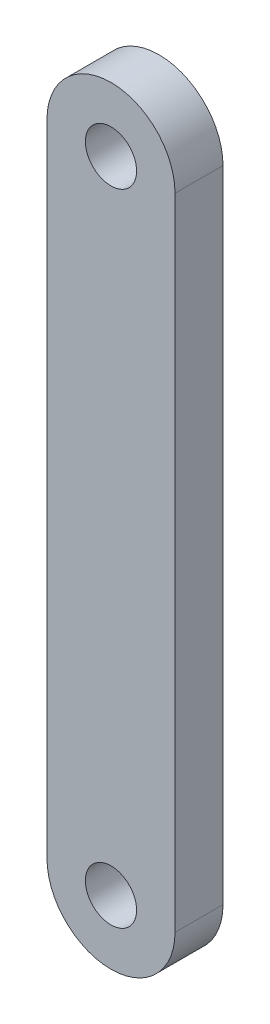
ISO-10303-21;
HEADER;
FILE_DESCRIPTION(('STEP AP214'),'2;1');
FILE_NAME('part.step','',(''),(''),'','','');
FILE_SCHEMA(('AUTOMOTIVE_DESIGN { 1 0 10303 214 1 1 1 1 }'));
ENDSEC;
DATA;
#1=APPLICATION_CONTEXT('core data for automotive mechanical design processes');
#2=APPLICATION_PROTOCOL_DEFINITION('international standard','automotive_design',2000,#1);
#3=PRODUCT_CONTEXT('',#1,'mechanical');
#4=PRODUCT('Part','Part','',(#3));
#5=PRODUCT_RELATED_PRODUCT_CATEGORY('part','',(#4));
#6=PRODUCT_DEFINITION_FORMATION('','',#4);
#7=PRODUCT_DEFINITION_CONTEXT('part definition',#1,'design');
#8=PRODUCT_DEFINITION('design','',#6,#7);
#9=PRODUCT_DEFINITION_SHAPE('','',#8);
#10=(LENGTH_UNIT() NAMED_UNIT(*) SI_UNIT(.MILLI.,.METRE.));
#11=(NAMED_UNIT(*) PLANE_ANGLE_UNIT() SI_UNIT($,.RADIAN.));
#12=(NAMED_UNIT(*) SI_UNIT($,.STERADIAN.) SOLID_ANGLE_UNIT());
#13=UNCERTAINTY_MEASURE_WITH_UNIT(LENGTH_MEASURE(1.E-05),#10,'distance_accuracy_value','');
#14=(GEOMETRIC_REPRESENTATION_CONTEXT(3) GLOBAL_UNCERTAINTY_ASSIGNED_CONTEXT((#13)) GLOBAL_UNIT_ASSIGNED_CONTEXT((#10,
#11,#12)) REPRESENTATION_CONTEXT('',''));
#15=CARTESIAN_POINT('',(0.,0.,0.));
#16=DIRECTION('',(0.,0.,1.));
#17=DIRECTION('',(1.,0.,0.));
#18=AXIS2_PLACEMENT_3D('',#15,#16,#17);
#19=CARTESIAN_POINT('',(0.,0.,-3.));
#20=DIRECTION('',(0.,0.,1.));
#21=DIRECTION('',(1.,0.,0.));
#22=AXIS2_PLACEMENT_3D('',#19,#20,#21);
#23=CYLINDRICAL_SURFACE('',#22,4.);
#24=CARTESIAN_POINT('',(0.,0.,0.));
#25=DIRECTION('',(0.,0.,1.));
#26=DIRECTION('',(1.,0.,0.));
#27=AXIS2_PLACEMENT_3D('',#24,#25,#26);
#28=CIRCLE('',#27,4.);
#29=CARTESIAN_POINT('',(-4.,0.,0.));
#30=VERTEX_POINT('',#29);
#31=CARTESIAN_POINT('',(4.,0.,0.));
#32=VERTEX_POINT('',#31);
#33=EDGE_CURVE('E110',#30,#32,#28,.T.);
#34=ORIENTED_EDGE('',*,*,#33,.F.);
#35=DIRECTION('',(0.,0.,1.));
#36=VECTOR('',#35,1.);
#37=CARTESIAN_POINT('',(-4.,0.,-3.));
#38=LINE('',#37,#36);
#39=CARTESIAN_POINT('',(-4.,0.,-3.));
#40=VERTEX_POINT('',#39);
#41=EDGE_CURVE('E11',#40,#30,#38,.T.);
#42=ORIENTED_EDGE('',*,*,#41,.F.);
#43=CARTESIAN_POINT('',(0.,0.,-3.));
#44=DIRECTION('',(0.,0.,1.));
#45=DIRECTION('',(1.,0.,0.));
#46=AXIS2_PLACEMENT_3D('',#43,#44,#45);
#47=CIRCLE('',#46,4.);
#48=CARTESIAN_POINT('',(4.,0.,-3.));
#49=VERTEX_POINT('',#48);
#50=EDGE_CURVE('E101',#40,#49,#47,.T.);
#51=ORIENTED_EDGE('',*,*,#50,.T.);
#52=DIRECTION('',(0.,0.,1.));
#53=VECTOR('',#52,1.);
#54=CARTESIAN_POINT('',(4.,0.,-3.));
#55=LINE('',#54,#53);
#56=EDGE_CURVE('E42',#49,#32,#55,.T.);
#57=ORIENTED_EDGE('',*,*,#56,.T.);
#58=EDGE_LOOP('',(#34,#42,#51,#57));
#59=FACE_BOUND('',#58,.T.);
#60=ADVANCED_FACE('F39',(#59),#23,.T.);
#61=CARTESIAN_POINT('',(-4.,0.,-3.));
#62=DIRECTION('',(-1.,0.,0.));
#63=DIRECTION('',(0.,0.,1.));
#64=AXIS2_PLACEMENT_3D('',#61,#62,#63);
#65=PLANE('',#64);
#66=DIRECTION('',(0.,-1.,0.));
#67=VECTOR('',#66,1.);
#68=CARTESIAN_POINT('',(-4.,0.,0.));
#69=LINE('',#68,#67);
#70=CARTESIAN_POINT('',(-4.,40.,0.));
#71=VERTEX_POINT('',#70);
#72=EDGE_CURVE('E104',#71,#30,#69,.T.);
#73=ORIENTED_EDGE('',*,*,#72,.F.);
#74=DIRECTION('',(0.,0.,1.));
#75=VECTOR('',#74,1.);
#76=CARTESIAN_POINT('',(-4.,40.,-3.));
#77=LINE('',#76,#75);
#78=CARTESIAN_POINT('',(-4.,40.,-3.));
#79=VERTEX_POINT('',#78);
#80=EDGE_CURVE('E49',#79,#71,#77,.T.);
#81=ORIENTED_EDGE('',*,*,#80,.F.);
#82=DIRECTION('',(0.,-1.,0.));
#83=VECTOR('',#82,1.);
#84=CARTESIAN_POINT('',(-4.,0.,-3.));
#85=LINE('',#84,#83);
#86=EDGE_CURVE('E96',#79,#40,#85,.T.);
#87=ORIENTED_EDGE('',*,*,#86,.T.);
#88=ORIENTED_EDGE('',*,*,#41,.T.);
#89=EDGE_LOOP('',(#73,#81,#87,#88));
#90=FACE_BOUND('',#89,.T.);
#91=ADVANCED_FACE('F127',(#90),#65,.T.);
#92=CARTESIAN_POINT('',(0.,40.,-3.));
#93=DIRECTION('',(0.,0.,1.));
#94=DIRECTION('',(1.,0.,0.));
#95=AXIS2_PLACEMENT_3D('',#92,#93,#94);
#96=CYLINDRICAL_SURFACE('',#95,4.);
#97=CARTESIAN_POINT('',(0.,40.,0.));
#98=DIRECTION('',(0.,0.,1.));
#99=DIRECTION('',(1.,0.,0.));
#100=AXIS2_PLACEMENT_3D('',#97,#98,#99);
#101=CIRCLE('',#100,4.);
#102=CARTESIAN_POINT('',(4.,40.,0.));
#103=VERTEX_POINT('',#102);
#104=EDGE_CURVE('E90',#103,#71,#101,.T.);
#105=ORIENTED_EDGE('',*,*,#104,.F.);
#106=DIRECTION('',(0.,0.,1.));
#107=VECTOR('',#106,1.);
#108=CARTESIAN_POINT('',(4.,40.,-3.));
#109=LINE('',#108,#107);
#110=CARTESIAN_POINT('',(4.,40.,-3.));
#111=VERTEX_POINT('',#110);
#112=EDGE_CURVE('E85',#111,#103,#109,.T.);
#113=ORIENTED_EDGE('',*,*,#112,.F.);
#114=CARTESIAN_POINT('',(0.,40.,-3.));
#115=DIRECTION('',(0.,0.,1.));
#116=DIRECTION('',(1.,0.,0.));
#117=AXIS2_PLACEMENT_3D('',#114,#115,#116);
#118=CIRCLE('',#117,4.);
#119=EDGE_CURVE('E88',#111,#79,#118,.T.);
#120=ORIENTED_EDGE('',*,*,#119,.T.);
#121=ORIENTED_EDGE('',*,*,#80,.T.);
#122=EDGE_LOOP('',(#105,#113,#120,#121));
#123=FACE_BOUND('',#122,.T.);
#124=ADVANCED_FACE('F87',(#123),#96,.T.);
#125=CARTESIAN_POINT('',(4.,0.,-3.));
#126=DIRECTION('',(1.,0.,0.));
#127=DIRECTION('',(0.,0.,-1.));
#128=AXIS2_PLACEMENT_3D('',#125,#126,#127);
#129=PLANE('',#128);
#130=DIRECTION('',(0.,1.,0.));
#131=VECTOR('',#130,1.);
#132=CARTESIAN_POINT('',(4.,0.,0.));
#133=LINE('',#132,#131);
#134=EDGE_CURVE('E114',#32,#103,#133,.T.);
#135=ORIENTED_EDGE('',*,*,#134,.F.);
#136=ORIENTED_EDGE('',*,*,#56,.F.);
#137=DIRECTION('',(0.,1.,0.));
#138=VECTOR('',#137,1.);
#139=CARTESIAN_POINT('',(4.,0.,-3.));
#140=LINE('',#139,#138);
#141=EDGE_CURVE('E95',#49,#111,#140,.T.);
#142=ORIENTED_EDGE('',*,*,#141,.T.);
#143=ORIENTED_EDGE('',*,*,#112,.T.);
#144=EDGE_LOOP('',(#135,#136,#142,#143));
#145=FACE_BOUND('',#144,.T.);
#146=ADVANCED_FACE('F99',(#145),#129,.T.);
#147=CARTESIAN_POINT('',(0.,0.,-3.));
#148=DIRECTION('',(0.,0.,1.));
#149=DIRECTION('',(1.,0.,0.));
#150=AXIS2_PLACEMENT_3D('',#147,#148,#149);
#151=PLANE('',#150);
#152=CARTESIAN_POINT('',(0.,0.,-3.));
#153=DIRECTION('',(0.,0.,1.));
#154=DIRECTION('',(1.,0.,0.));
#155=AXIS2_PLACEMENT_3D('',#152,#153,#154);
#156=CIRCLE('',#155,1.6);
#157=CARTESIAN_POINT('',(1.6,0.,-3.));
#158=VERTEX_POINT('',#157);
#159=EDGE_CURVE('E115',#158,#158,#156,.T.);
#160=ORIENTED_EDGE('',*,*,#159,.T.);
#161=EDGE_LOOP('',(#160));
#162=FACE_BOUND('',#161,.T.);
#163=CARTESIAN_POINT('',(0.,40.,-3.));
#164=DIRECTION('',(0.,0.,1.));
#165=DIRECTION('',(1.,0.,0.));
#166=AXIS2_PLACEMENT_3D('',#163,#164,#165);
#167=CIRCLE('',#166,1.6);
#168=CARTESIAN_POINT('',(1.6,40.,-3.));
#169=VERTEX_POINT('',#168);
#170=EDGE_CURVE('E164',#169,#169,#167,.T.);
#171=ORIENTED_EDGE('',*,*,#170,.T.);
#172=EDGE_LOOP('',(#171));
#173=FACE_BOUND('',#172,.T.);
#174=ORIENTED_EDGE('',*,*,#50,.F.);
#175=ORIENTED_EDGE('',*,*,#86,.F.);
#176=ORIENTED_EDGE('',*,*,#119,.F.);
#177=ORIENTED_EDGE('',*,*,#141,.F.);
#178=EDGE_LOOP('',(#174,#175,#176,#177));
#179=FACE_BOUND('',#178,.T.);
#180=ADVANCED_FACE('F94',(#162,#173,#179),#151,.F.);
#181=CARTESIAN_POINT('',(0.,0.,0.));
#182=DIRECTION('',(0.,0.,1.));
#183=DIRECTION('',(1.,0.,0.));
#184=AXIS2_PLACEMENT_3D('',#181,#182,#183);
#185=PLANE('',#184);
#186=CARTESIAN_POINT('',(0.,0.,0.));
#187=DIRECTION('',(0.,0.,1.));
#188=DIRECTION('',(1.,0.,0.));
#189=AXIS2_PLACEMENT_3D('',#186,#187,#188);
#190=CIRCLE('',#189,1.6);
#191=CARTESIAN_POINT('',(1.6,0.,0.));
#192=VERTEX_POINT('',#191);
#193=EDGE_CURVE('E162',#192,#192,#190,.T.);
#194=ORIENTED_EDGE('',*,*,#193,.F.);
#195=EDGE_LOOP('',(#194));
#196=FACE_BOUND('',#195,.T.);
#197=CARTESIAN_POINT('',(0.,40.,0.));
#198=DIRECTION('',(0.,0.,1.));
#199=DIRECTION('',(1.,0.,0.));
#200=AXIS2_PLACEMENT_3D('',#197,#198,#199);
#201=CIRCLE('',#200,1.6);
#202=CARTESIAN_POINT('',(1.6,40.,0.));
#203=VERTEX_POINT('',#202);
#204=EDGE_CURVE('E170',#203,#203,#201,.T.);
#205=ORIENTED_EDGE('',*,*,#204,.F.);
#206=EDGE_LOOP('',(#205));
#207=FACE_BOUND('',#206,.T.);
#208=ORIENTED_EDGE('',*,*,#33,.T.);
#209=ORIENTED_EDGE('',*,*,#134,.T.);
#210=ORIENTED_EDGE('',*,*,#104,.T.);
#211=ORIENTED_EDGE('',*,*,#72,.T.);
#212=EDGE_LOOP('',(#208,#209,#210,#211));
#213=FACE_BOUND('',#212,.T.);
#214=ADVANCED_FACE('F126',(#196,#207,#213),#185,.T.);
#215=CARTESIAN_POINT('',(0.,40.,-3.));
#216=DIRECTION('',(0.,0.,1.));
#217=DIRECTION('',(1.,0.,0.));
#218=AXIS2_PLACEMENT_3D('',#215,#216,#217);
#219=CYLINDRICAL_SURFACE('',#218,1.6);
#220=ORIENTED_EDGE('',*,*,#170,.F.);
#221=EDGE_LOOP('',(#220));
#222=FACE_BOUND('',#221,.T.);
#223=ORIENTED_EDGE('',*,*,#204,.T.);
#224=EDGE_LOOP('',(#223));
#225=FACE_BOUND('',#224,.T.);
#226=ADVANCED_FACE('F145',(#222,#225),#219,.F.);
#227=CARTESIAN_POINT('',(0.,0.,-3.));
#228=DIRECTION('',(0.,0.,1.));
#229=DIRECTION('',(1.,0.,0.));
#230=AXIS2_PLACEMENT_3D('',#227,#228,#229);
#231=CYLINDRICAL_SURFACE('',#230,1.6);
#232=ORIENTED_EDGE('',*,*,#159,.F.);
#233=EDGE_LOOP('',(#232));
#234=FACE_BOUND('',#233,.T.);
#235=ORIENTED_EDGE('',*,*,#193,.T.);
#236=EDGE_LOOP('',(#235));
#237=FACE_BOUND('',#236,.T.);
#238=ADVANCED_FACE('F152',(#234,#237),#231,.F.);
#239=CLOSED_SHELL('',(#60,#91,#124,#146,#180,#214,#226,#238));
#240=MANIFOLD_SOLID_BREP('B2',#239);
#241=ADVANCED_BREP_SHAPE_REPRESENTATION('',(#18,#240),#14);
#242=SHAPE_DEFINITION_REPRESENTATION(#9,#241);
ENDSEC;
END-ISO-10303-21;
